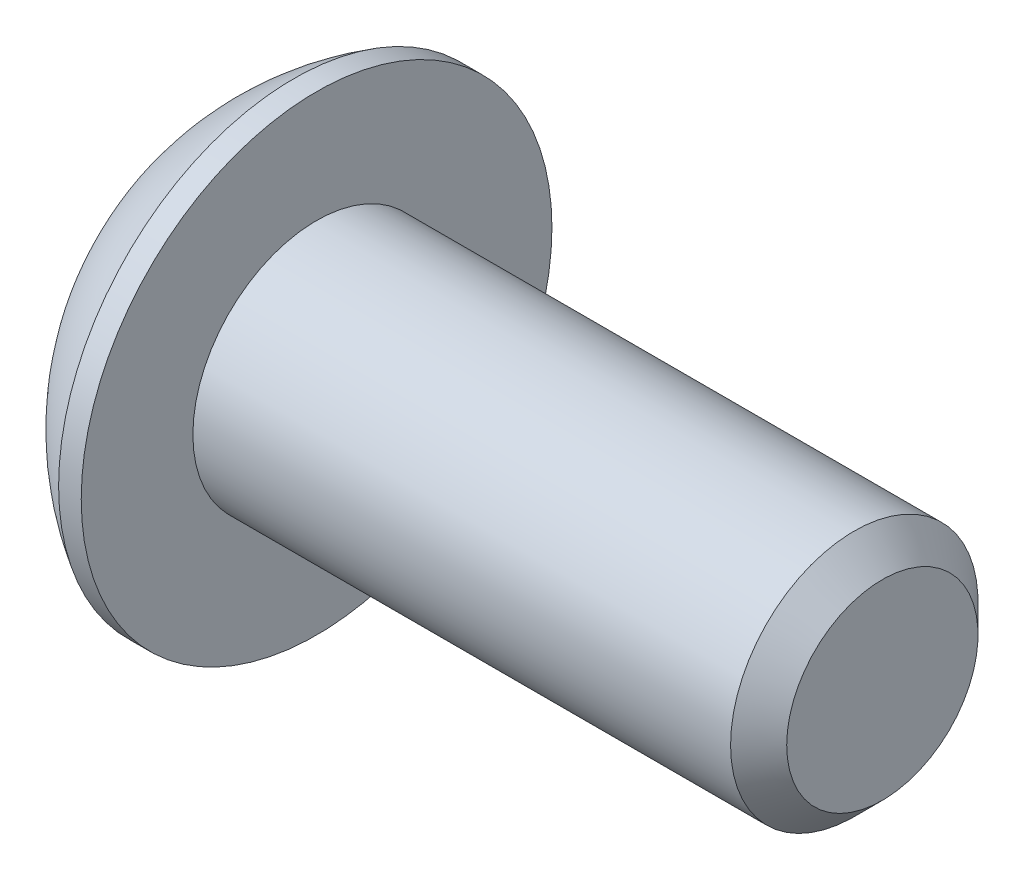
ISO-10303-21;
HEADER;
FILE_DESCRIPTION(('STEP AP214'),'2;1');
FILE_NAME('part.step','',(''),(''),'','','');
FILE_SCHEMA(('AUTOMOTIVE_DESIGN { 1 0 10303 214 1 1 1 1 }'));
ENDSEC;
DATA;
#1=APPLICATION_CONTEXT('core data for automotive mechanical design processes');
#2=APPLICATION_PROTOCOL_DEFINITION('international standard','automotive_design',2000,#1);
#3=PRODUCT_CONTEXT('',#1,'mechanical');
#4=PRODUCT('Part','Part','',(#3));
#5=PRODUCT_RELATED_PRODUCT_CATEGORY('part','',(#4));
#6=PRODUCT_DEFINITION_FORMATION('','',#4);
#7=PRODUCT_DEFINITION_CONTEXT('part definition',#1,'design');
#8=PRODUCT_DEFINITION('design','',#6,#7);
#9=PRODUCT_DEFINITION_SHAPE('','',#8);
#10=(LENGTH_UNIT() NAMED_UNIT(*) SI_UNIT(.MILLI.,.METRE.));
#11=(NAMED_UNIT(*) PLANE_ANGLE_UNIT() SI_UNIT($,.RADIAN.));
#12=(NAMED_UNIT(*) SI_UNIT($,.STERADIAN.) SOLID_ANGLE_UNIT());
#13=UNCERTAINTY_MEASURE_WITH_UNIT(LENGTH_MEASURE(1.E-05),#10,'distance_accuracy_value','');
#14=(GEOMETRIC_REPRESENTATION_CONTEXT(3) GLOBAL_UNCERTAINTY_ASSIGNED_CONTEXT((#13)) GLOBAL_UNIT_ASSIGNED_CONTEXT((#10,
#11,#12)) REPRESENTATION_CONTEXT('',''));
#15=CARTESIAN_POINT('',(0.,0.,0.));
#16=DIRECTION('',(0.,0.,1.));
#17=DIRECTION('',(1.,0.,0.));
#18=AXIS2_PLACEMENT_3D('',#15,#16,#17);
#19=CARTESIAN_POINT('',(1.32080000014412,0.,0.));
#20=DIRECTION('',(-1.,0.,0.));
#21=DIRECTION('',(0.,0.,1.));
#22=AXIS2_PLACEMENT_3D('',#19,#20,#21);
#23=CONICAL_SURFACE('',#22,1.19379999978264,1.04719755093309);
#24=CARTESIAN_POINT('',(2.01004075151445,0.,2.27373675443232E-10));
#25=VERTEX_POINT('',#24);
#26=VERTEX_LOOP('',#25);
#27=FACE_BOUND('',#26,.T.);
#28=CARTESIAN_POINT('',(1.32080000001284,0.,0.));
#29=DIRECTION('',(-1.,0.,0.));
#30=DIRECTION('',(0.,0.,1.));
#31=AXIS2_PLACEMENT_3D('',#28,#29,#30);
#32=CIRCLE('',#31,1.19380000001001);
#33=CARTESIAN_POINT('',(1.32080000000644,-1.0338611270422,0.596900000002507));
#34=VERTEX_POINT('',#33);
#35=CARTESIAN_POINT('',(1.32080000000644,0.,1.19380000000501));
#36=VERTEX_POINT('',#35);
#37=EDGE_CURVE('E91',#34,#36,#32,.T.);
#38=ORIENTED_EDGE('',*,*,#37,.T.);
#39=CARTESIAN_POINT('',(1.32080000001284,0.,0.));
#40=DIRECTION('',(-1.,0.,0.));
#41=DIRECTION('',(0.,0.,1.));
#42=AXIS2_PLACEMENT_3D('',#39,#40,#41);
#43=CIRCLE('',#42,1.19380000001001);
#44=CARTESIAN_POINT('',(1.32080000000644,1.0338611270422,0.596900000002507));
#45=VERTEX_POINT('',#44);
#46=EDGE_CURVE('E87',#36,#45,#43,.T.);
#47=ORIENTED_EDGE('',*,*,#46,.T.);
#48=CARTESIAN_POINT('',(1.32080000001284,0.,0.));
#49=DIRECTION('',(-1.,0.,0.));
#50=DIRECTION('',(0.,0.,1.));
#51=AXIS2_PLACEMENT_3D('',#48,#49,#50);
#52=CIRCLE('',#51,1.19380000001001);
#53=CARTESIAN_POINT('',(1.32080000000644,1.0338611270422,-0.596900000002503));
#54=VERTEX_POINT('',#53);
#55=EDGE_CURVE('E20',#45,#54,#52,.T.);
#56=ORIENTED_EDGE('',*,*,#55,.T.);
#57=CARTESIAN_POINT('',(1.32080000001284,0.,0.));
#58=DIRECTION('',(-1.,0.,0.));
#59=DIRECTION('',(0.,0.,1.));
#60=AXIS2_PLACEMENT_3D('',#57,#58,#59);
#61=CIRCLE('',#60,1.19380000001001);
#62=CARTESIAN_POINT('',(1.32080000000644,1.49193044797401E-12,-1.193800000005));
#63=VERTEX_POINT('',#62);
#64=EDGE_CURVE('E150',#54,#63,#61,.T.);
#65=ORIENTED_EDGE('',*,*,#64,.T.);
#66=CARTESIAN_POINT('',(1.32080000001284,0.,0.));
#67=DIRECTION('',(-1.,0.,0.));
#68=DIRECTION('',(0.,0.,1.));
#69=AXIS2_PLACEMENT_3D('',#66,#67,#68);
#70=CIRCLE('',#69,1.19380000001001);
#71=CARTESIAN_POINT('',(1.32080000000644,-1.03386112704219,-0.596900000002507));
#72=VERTEX_POINT('',#71);
#73=EDGE_CURVE('E152',#63,#72,#70,.T.);
#74=ORIENTED_EDGE('',*,*,#73,.T.);
#75=CARTESIAN_POINT('',(1.32080000001284,0.,0.));
#76=DIRECTION('',(-1.,0.,0.));
#77=DIRECTION('',(0.,0.,1.));
#78=AXIS2_PLACEMENT_3D('',#75,#76,#77);
#79=CIRCLE('',#78,1.19380000001001);
#80=EDGE_CURVE('E154',#72,#34,#79,.T.);
#81=ORIENTED_EDGE('',*,*,#80,.T.);
#82=EDGE_LOOP('',(#38,#47,#56,#65,#74,#81));
#83=FACE_BOUND('',#82,.T.);
#84=ADVANCED_FACE('F16',(#27,#83),#23,.F.);
#85=CARTESIAN_POINT('',(1.32080000000001,-2.06772225407572,-1.19379999999998));
#86=DIRECTION('',(1.,0.,0.));
#87=DIRECTION('',(0.,0.,-1.));
#88=AXIS2_PLACEMENT_3D('',#85,#86,#87);
#89=PLANE('',#88);
#90=DIRECTION('',(0.,-0.5,-0.866025403784439));
#91=VECTOR('',#90,1.);
#92=CARTESIAN_POINT('',(1.32080000000004,1.37848150271715,0.));
#93=LINE('',#92,#91);
#94=CARTESIAN_POINT('',(1.32080000000002,1.37848150271715,0.));
#95=VERTEX_POINT('',#94);
#96=EDGE_CURVE('E103',#54,#95,#93,.F.);
#97=ORIENTED_EDGE('',*,*,#96,.F.);
#98=ORIENTED_EDGE('',*,*,#55,.F.);
#99=DIRECTION('',(0.,0.5,-0.866025403784439));
#100=VECTOR('',#99,1.);
#101=CARTESIAN_POINT('',(1.32080000000001,0.689240751358577,1.1938));
#102=LINE('',#101,#100);
#103=EDGE_CURVE('E101',#95,#45,#102,.F.);
#104=ORIENTED_EDGE('',*,*,#103,.F.);
#105=EDGE_LOOP('',(#97,#98,#104));
#106=FACE_BOUND('',#105,.T.);
#107=ADVANCED_FACE('F99',(#106),#89,.F.);
#108=CARTESIAN_POINT('',(1.32080000000001,-2.06772225407572,-1.19379999999998));
#109=DIRECTION('',(1.,0.,0.));
#110=DIRECTION('',(0.,0.,-1.));
#111=AXIS2_PLACEMENT_3D('',#108,#109,#110);
#112=PLANE('',#111);
#113=DIRECTION('',(0.,0.5,-0.866025403784439));
#114=VECTOR('',#113,1.);
#115=CARTESIAN_POINT('',(1.32080000000004,0.689240751358577,1.1938));
#116=LINE('',#115,#114);
#117=CARTESIAN_POINT('',(1.32080000000002,0.689240751358577,1.1938));
#118=VERTEX_POINT('',#117);
#119=EDGE_CURVE('E105',#45,#118,#116,.F.);
#120=ORIENTED_EDGE('',*,*,#119,.F.);
#121=ORIENTED_EDGE('',*,*,#46,.F.);
#122=DIRECTION('',(0.,1.,0.));
#123=VECTOR('',#122,1.);
#124=CARTESIAN_POINT('',(1.32080000000001,-0.689240751358573,1.19380000000001));
#125=LINE('',#124,#123);
#126=EDGE_CURVE('E108',#118,#36,#125,.F.);
#127=ORIENTED_EDGE('',*,*,#126,.F.);
#128=EDGE_LOOP('',(#120,#121,#127));
#129=FACE_BOUND('',#128,.T.);
#130=ADVANCED_FACE('F106',(#129),#112,.F.);
#131=CARTESIAN_POINT('',(1.32080000000001,-2.06772225407572,-1.19379999999998));
#132=DIRECTION('',(1.,0.,0.));
#133=DIRECTION('',(0.,0.,-1.));
#134=AXIS2_PLACEMENT_3D('',#131,#132,#133);
#135=PLANE('',#134);
#136=DIRECTION('',(0.,1.,0.));
#137=VECTOR('',#136,1.);
#138=CARTESIAN_POINT('',(1.32080000000004,-0.689240751358573,1.19380000000001));
#139=LINE('',#138,#137);
#140=CARTESIAN_POINT('',(1.32080000000002,-0.689240751358577,1.19380000000001));
#141=VERTEX_POINT('',#140);
#142=EDGE_CURVE('E168',#36,#141,#139,.F.);
#143=ORIENTED_EDGE('',*,*,#142,.F.);
#144=ORIENTED_EDGE('',*,*,#37,.F.);
#145=DIRECTION('',(0.,0.5,0.866025403784439));
#146=VECTOR('',#145,1.);
#147=CARTESIAN_POINT('',(1.32080000000001,-1.37848150271715,0.));
#148=LINE('',#147,#146);
#149=EDGE_CURVE('E166',#141,#34,#148,.F.);
#150=ORIENTED_EDGE('',*,*,#149,.F.);
#151=EDGE_LOOP('',(#143,#144,#150));
#152=FACE_BOUND('',#151,.T.);
#153=ADVANCED_FACE('F164',(#152),#135,.F.);
#154=CARTESIAN_POINT('',(1.32080000000001,-2.06772225407572,-1.19379999999998));
#155=DIRECTION('',(1.,0.,0.));
#156=DIRECTION('',(0.,0.,-1.));
#157=AXIS2_PLACEMENT_3D('',#154,#155,#156);
#158=PLANE('',#157);
#159=DIRECTION('',(0.,0.5,0.866025403784439));
#160=VECTOR('',#159,1.);
#161=CARTESIAN_POINT('',(1.32080000000004,-1.37848150271715,0.));
#162=LINE('',#161,#160);
#163=CARTESIAN_POINT('',(1.32080000000002,-1.37848150271715,0.));
#164=VERTEX_POINT('',#163);
#165=EDGE_CURVE('E169',#34,#164,#162,.F.);
#166=ORIENTED_EDGE('',*,*,#165,.F.);
#167=ORIENTED_EDGE('',*,*,#80,.F.);
#168=DIRECTION('',(0.,-0.5,0.866025403784439));
#169=VECTOR('',#168,1.);
#170=CARTESIAN_POINT('',(1.32080000000001,-0.689240751358573,-1.19379999999999));
#171=LINE('',#170,#169);
#172=EDGE_CURVE('E172',#164,#72,#171,.F.);
#173=ORIENTED_EDGE('',*,*,#172,.F.);
#174=EDGE_LOOP('',(#166,#167,#173));
#175=FACE_BOUND('',#174,.T.);
#176=ADVANCED_FACE('F170',(#175),#158,.F.);
#177=CARTESIAN_POINT('',(1.32080000000001,-2.06772225407572,-1.19379999999998));
#178=DIRECTION('',(1.,0.,0.));
#179=DIRECTION('',(0.,0.,-1.));
#180=AXIS2_PLACEMENT_3D('',#177,#178,#179);
#181=PLANE('',#180);
#182=DIRECTION('',(0.,-0.5,0.866025403784439));
#183=VECTOR('',#182,1.);
#184=CARTESIAN_POINT('',(1.32080000000004,-0.689240751358573,-1.19379999999999));
#185=LINE('',#184,#183);
#186=CARTESIAN_POINT('',(1.32080000000002,-0.689240751358573,-1.19379999999999));
#187=VERTEX_POINT('',#186);
#188=EDGE_CURVE('E227',#72,#187,#185,.F.);
#189=ORIENTED_EDGE('',*,*,#188,.F.);
#190=ORIENTED_EDGE('',*,*,#73,.F.);
#191=DIRECTION('',(0.,1.,0.));
#192=VECTOR('',#191,1.);
#193=CARTESIAN_POINT('',(1.32080000000001,0.689240751358577,-1.19379999999999));
#194=LINE('',#193,#192);
#195=EDGE_CURVE('E239',#187,#63,#194,.T.);
#196=ORIENTED_EDGE('',*,*,#195,.F.);
#197=EDGE_LOOP('',(#189,#190,#196));
#198=FACE_BOUND('',#197,.T.);
#199=ADVANCED_FACE('F389',(#198),#181,.F.);
#200=CARTESIAN_POINT('',(1.32080000000001,-2.06772225407572,-1.19379999999998));
#201=DIRECTION('',(1.,0.,0.));
#202=DIRECTION('',(0.,0.,-1.));
#203=AXIS2_PLACEMENT_3D('',#200,#201,#202);
#204=PLANE('',#203);
#205=DIRECTION('',(0.,1.,0.));
#206=VECTOR('',#205,1.);
#207=CARTESIAN_POINT('',(1.32080000000004,0.689240751358577,-1.19379999999999));
#208=LINE('',#207,#206);
#209=CARTESIAN_POINT('',(1.32080000000002,0.689240751358564,-1.19380000000002));
#210=VERTEX_POINT('',#209);
#211=EDGE_CURVE('E247',#63,#210,#208,.T.);
#212=ORIENTED_EDGE('',*,*,#211,.F.);
#213=ORIENTED_EDGE('',*,*,#64,.F.);
#214=DIRECTION('',(0.,-0.5,-0.866025403784439));
#215=VECTOR('',#214,1.);
#216=CARTESIAN_POINT('',(1.32080000000001,1.37848150271715,0.));
#217=LINE('',#216,#215);
#218=EDGE_CURVE('E127',#210,#54,#217,.F.);
#219=ORIENTED_EDGE('',*,*,#218,.F.);
#220=EDGE_LOOP('',(#212,#213,#219));
#221=FACE_BOUND('',#220,.T.);
#222=ADVANCED_FACE('F379',(#221),#204,.F.);
#223=CARTESIAN_POINT('',(1.32080000000001,1.37848150271715,0.));
#224=DIRECTION('',(0.,-0.866025403784439,0.5));
#225=DIRECTION('',(0.,-0.5,-0.866025403784439));
#226=AXIS2_PLACEMENT_3D('',#223,#224,#225);
#227=PLANE('',#226);
#228=ORIENTED_EDGE('',*,*,#96,.T.);
#229=DIRECTION('',(1.,0.,0.));
#230=VECTOR('',#229,1.);
#231=CARTESIAN_POINT('',(1.32080000000001,1.37848150271715,0.));
#232=LINE('',#231,#230);
#233=CARTESIAN_POINT('',(0.,1.37848150271715,0.));
#234=VERTEX_POINT('',#233);
#235=EDGE_CURVE('E115',#234,#95,#232,.T.);
#236=ORIENTED_EDGE('',*,*,#235,.F.);
#237=DIRECTION('',(0.,0.499999999999998,0.86602540378444));
#238=VECTOR('',#237,1.);
#239=CARTESIAN_POINT('',(0.,0.689240751358577,-1.1938));
#240=LINE('',#239,#238);
#241=CARTESIAN_POINT('',(0.,0.689240751358577,-1.1938));
#242=VERTEX_POINT('',#241);
#243=EDGE_CURVE('E130',#242,#234,#240,.T.);
#244=ORIENTED_EDGE('',*,*,#243,.F.);
#245=DIRECTION('',(1.,0.,0.));
#246=VECTOR('',#245,1.);
#247=CARTESIAN_POINT('',(1.32080000000001,0.689240751358577,-1.19379999999999));
#248=LINE('',#247,#246);
#249=EDGE_CURVE('E134',#210,#242,#248,.F.);
#250=ORIENTED_EDGE('',*,*,#249,.F.);
#251=ORIENTED_EDGE('',*,*,#218,.T.);
#252=EDGE_LOOP('',(#228,#236,#244,#250,#251));
#253=FACE_BOUND('',#252,.T.);
#254=ADVANCED_FACE('F370',(#253),#227,.T.);
#255=CARTESIAN_POINT('',(1.32080000000001,0.689240751358577,1.1938));
#256=DIRECTION('',(0.,-0.866025403784439,-0.5));
#257=DIRECTION('',(0.,0.5,-0.866025403784439));
#258=AXIS2_PLACEMENT_3D('',#255,#256,#257);
#259=PLANE('',#258);
#260=ORIENTED_EDGE('',*,*,#119,.T.);
#261=DIRECTION('',(1.,0.,0.));
#262=VECTOR('',#261,1.);
#263=CARTESIAN_POINT('',(1.32080000000001,0.689240751358577,1.19380000000001));
#264=LINE('',#263,#262);
#265=CARTESIAN_POINT('',(0.,0.689240751358577,1.1938));
#266=VERTEX_POINT('',#265);
#267=EDGE_CURVE('E111',#266,#118,#264,.T.);
#268=ORIENTED_EDGE('',*,*,#267,.F.);
#269=DIRECTION('',(0.,-0.500000000000004,0.866025403784437));
#270=VECTOR('',#269,1.);
#271=CARTESIAN_POINT('',(0.,1.37848150271715,0.));
#272=LINE('',#271,#270);
#273=EDGE_CURVE('E133',#234,#266,#272,.T.);
#274=ORIENTED_EDGE('',*,*,#273,.F.);
#275=ORIENTED_EDGE('',*,*,#235,.T.);
#276=ORIENTED_EDGE('',*,*,#103,.T.);
#277=EDGE_LOOP('',(#260,#268,#274,#275,#276));
#278=FACE_BOUND('',#277,.T.);
#279=ADVANCED_FACE('F113',(#278),#259,.T.);
#280=CARTESIAN_POINT('',(1.32080000000001,-0.689240751358573,1.19380000000001));
#281=DIRECTION('',(0.,0.,-1.));
#282=DIRECTION('',(0.,1.,0.));
#283=AXIS2_PLACEMENT_3D('',#280,#281,#282);
#284=PLANE('',#283);
#285=ORIENTED_EDGE('',*,*,#142,.T.);
#286=DIRECTION('',(1.,0.,0.));
#287=VECTOR('',#286,1.);
#288=CARTESIAN_POINT('',(1.32080000000001,-0.689240751358579,1.19380000000001));
#289=LINE('',#288,#287);
#290=CARTESIAN_POINT('',(0.,-0.689240751358577,1.19380000000001));
#291=VERTEX_POINT('',#290);
#292=EDGE_CURVE('E179',#291,#141,#289,.T.);
#293=ORIENTED_EDGE('',*,*,#292,.F.);
#294=DIRECTION('',(0.,1.,0.));
#295=VECTOR('',#294,1.);
#296=CARTESIAN_POINT('',(0.,0.,1.1938));
#297=LINE('',#296,#295);
#298=EDGE_CURVE('E193',#266,#291,#297,.F.);
#299=ORIENTED_EDGE('',*,*,#298,.F.);
#300=ORIENTED_EDGE('',*,*,#267,.T.);
#301=ORIENTED_EDGE('',*,*,#126,.T.);
#302=EDGE_LOOP('',(#285,#293,#299,#300,#301));
#303=FACE_BOUND('',#302,.T.);
#304=ADVANCED_FACE('F215',(#303),#284,.T.);
#305=CARTESIAN_POINT('',(1.32080000000001,-1.37848150271715,0.));
#306=DIRECTION('',(0.,0.866025403784439,-0.5));
#307=DIRECTION('',(0.,0.5,0.866025403784439));
#308=AXIS2_PLACEMENT_3D('',#305,#306,#307);
#309=PLANE('',#308);
#310=ORIENTED_EDGE('',*,*,#165,.T.);
#311=DIRECTION('',(1.,0.,0.));
#312=VECTOR('',#311,1.);
#313=CARTESIAN_POINT('',(1.32080000000001,-1.37848150271715,0.));
#314=LINE('',#313,#312);
#315=CARTESIAN_POINT('',(0.,-1.37848150271715,0.));
#316=VERTEX_POINT('',#315);
#317=EDGE_CURVE('E175',#316,#164,#314,.T.);
#318=ORIENTED_EDGE('',*,*,#317,.F.);
#319=DIRECTION('',(0.,-0.499999999999999,-0.866025403784439));
#320=VECTOR('',#319,1.);
#321=CARTESIAN_POINT('',(0.,-0.689240751358573,1.19380000000001));
#322=LINE('',#321,#320);
#323=EDGE_CURVE('E196',#291,#316,#322,.T.);
#324=ORIENTED_EDGE('',*,*,#323,.F.);
#325=ORIENTED_EDGE('',*,*,#292,.T.);
#326=ORIENTED_EDGE('',*,*,#149,.T.);
#327=EDGE_LOOP('',(#310,#318,#324,#325,#326));
#328=FACE_BOUND('',#327,.T.);
#329=ADVANCED_FACE('F177',(#328),#309,.T.);
#330=CARTESIAN_POINT('',(1.32080000000001,-0.689240751358573,-1.19379999999999));
#331=DIRECTION('',(0.,0.866025403784439,0.5));
#332=DIRECTION('',(0.,-0.5,0.866025403784439));
#333=AXIS2_PLACEMENT_3D('',#330,#331,#332);
#334=PLANE('',#333);
#335=ORIENTED_EDGE('',*,*,#188,.T.);
#336=DIRECTION('',(1.,0.,0.));
#337=VECTOR('',#336,1.);
#338=CARTESIAN_POINT('',(1.32080000000001,-0.689240751358573,-1.19379999999999));
#339=LINE('',#338,#337);
#340=CARTESIAN_POINT('',(0.,-0.689240751358573,-1.19379999999999));
#341=VERTEX_POINT('',#340);
#342=EDGE_CURVE('E35',#341,#187,#339,.T.);
#343=ORIENTED_EDGE('',*,*,#342,.F.);
#344=DIRECTION('',(0.,0.499999999999998,-0.86602540378444));
#345=VECTOR('',#344,1.);
#346=CARTESIAN_POINT('',(0.,-1.37848150271715,0.));
#347=LINE('',#346,#345);
#348=EDGE_CURVE('E216',#316,#341,#347,.T.);
#349=ORIENTED_EDGE('',*,*,#348,.F.);
#350=ORIENTED_EDGE('',*,*,#317,.T.);
#351=ORIENTED_EDGE('',*,*,#172,.T.);
#352=EDGE_LOOP('',(#335,#343,#349,#350,#351));
#353=FACE_BOUND('',#352,.T.);
#354=ADVANCED_FACE('F336',(#353),#334,.T.);
#355=CARTESIAN_POINT('',(1.32080000000001,0.689240751358577,-1.19379999999999));
#356=DIRECTION('',(0.,0.,1.));
#357=DIRECTION('',(1.,0.,0.));
#358=AXIS2_PLACEMENT_3D('',#355,#356,#357);
#359=PLANE('',#358);
#360=ORIENTED_EDGE('',*,*,#211,.T.);
#361=ORIENTED_EDGE('',*,*,#249,.T.);
#362=DIRECTION('',(0.,1.,0.));
#363=VECTOR('',#362,1.);
#364=CARTESIAN_POINT('',(0.,0.,-1.19379999999999));
#365=LINE('',#364,#363);
#366=EDGE_CURVE('E149',#341,#242,#365,.T.);
#367=ORIENTED_EDGE('',*,*,#366,.F.);
#368=ORIENTED_EDGE('',*,*,#342,.T.);
#369=ORIENTED_EDGE('',*,*,#195,.T.);
#370=EDGE_LOOP('',(#360,#361,#367,#368,#369));
#371=FACE_BOUND('',#370,.T.);
#372=ADVANCED_FACE('F327',(#371),#359,.T.);
#373=CARTESIAN_POINT('',(0.,0.,0.));
#374=DIRECTION('',(-1.,0.,0.));
#375=DIRECTION('',(0.,0.,1.));
#376=AXIS2_PLACEMENT_3D('',#373,#374,#375);
#377=PLANE('',#376);
#378=CARTESIAN_POINT('',(0.,0.,0.));
#379=DIRECTION('',(-1.,0.,0.));
#380=DIRECTION('',(0.,0.,1.));
#381=AXIS2_PLACEMENT_3D('',#378,#379,#380);
#382=CIRCLE('',#381,1.98120000000003);
#383=CARTESIAN_POINT('',(0.,0.,1.98120000000004));
#384=VERTEX_POINT('',#383);
#385=EDGE_CURVE('E146',#384,#384,#382,.F.);
#386=ORIENTED_EDGE('',*,*,#385,.F.);
#387=EDGE_LOOP('',(#386));
#388=FACE_BOUND('',#387,.T.);
#389=ORIENTED_EDGE('',*,*,#348,.T.);
#390=ORIENTED_EDGE('',*,*,#366,.T.);
#391=ORIENTED_EDGE('',*,*,#243,.T.);
#392=ORIENTED_EDGE('',*,*,#273,.T.);
#393=ORIENTED_EDGE('',*,*,#298,.T.);
#394=ORIENTED_EDGE('',*,*,#323,.T.);
#395=EDGE_LOOP('',(#389,#390,#391,#392,#393,#394));
#396=FACE_BOUND('',#395,.T.);
#397=ADVANCED_FACE('F209',(#388,#396),#377,.T.);
#398=CARTESIAN_POINT('',(4.13384999999999,0.,0.));
#399=DIRECTION('',(0.,1.,0.));
#400=DIRECTION('',(-0.48966740395494,0.,-0.87190930348519));
#401=AXIS2_PLACEMENT_3D('',#398,#399,#400);
#402=SPHERICAL_SURFACE('',#401,4.5840887057844);
#403=CARTESIAN_POINT('',(4.13384999999999,0.,0.));
#404=DIRECTION('',(-1.,0.,0.));
#405=DIRECTION('',(0.,0.,1.));
#406=AXIS2_PLACEMENT_3D('',#403,#404,#405);
#407=SPHERICAL_SURFACE('',#406,4.5840887057844);
#408=ORIENTED_EDGE('',*,*,#385,.T.);
#409=EDGE_LOOP('',(#408));
#410=FACE_BOUND('',#409,.T.);
#411=CARTESIAN_POINT('',(1.82879999999999,0.,0.));
#412=DIRECTION('',(-1.,0.,0.));
#413=DIRECTION('',(0.,0.,1.));
#414=AXIS2_PLACEMENT_3D('',#411,#412,#413);
#415=CIRCLE('',#414,3.9624);
#416=CARTESIAN_POINT('',(1.82879999999999,0.,3.9624));
#417=VERTEX_POINT('',#416);
#418=EDGE_CURVE('E143',#417,#417,#415,.F.);
#419=ORIENTED_EDGE('',*,*,#418,.F.);
#420=EDGE_LOOP('',(#419));
#421=FACE_BOUND('',#420,.T.);
#422=ADVANCED_FACE('F18',(#410,#421),#407,.T.);
#423=CARTESIAN_POINT('',(11.7348,0.,0.));
#424=DIRECTION('',(-1.,0.,0.));
#425=DIRECTION('',(0.,0.,1.));
#426=AXIS2_PLACEMENT_3D('',#423,#424,#425);
#427=PLANE('',#426);
#428=CARTESIAN_POINT('',(11.7347999998856,0.,0.));
#429=DIRECTION('',(-1.,0.,0.));
#430=DIRECTION('',(0.,0.,1.));
#431=AXIS2_PLACEMENT_3D('',#428,#429,#430);
#432=CIRCLE('',#431,1.61036000008608);
#433=CARTESIAN_POINT('',(11.7347999998856,0.,1.61036000008608));
#434=VERTEX_POINT('',#433);
#435=EDGE_CURVE('E140',#434,#434,#432,.T.);
#436=ORIENTED_EDGE('',*,*,#435,.F.);
#437=EDGE_LOOP('',(#436));
#438=FACE_BOUND('',#437,.T.);
#439=ADVANCED_FACE('F269',(#438),#427,.F.);
#440=CARTESIAN_POINT('',(0.,0.,0.));
#441=DIRECTION('',(-1.,0.,0.));
#442=DIRECTION('',(0.,0.,1.));
#443=AXIS2_PLACEMENT_3D('',#440,#441,#442);
#444=CYLINDRICAL_SURFACE('',#443,3.9624);
#445=ORIENTED_EDGE('',*,*,#418,.T.);
#446=EDGE_LOOP('',(#445));
#447=FACE_BOUND('',#446,.T.);
#448=CARTESIAN_POINT('',(2.20980000000001,0.,0.));
#449=DIRECTION('',(-1.,0.,0.));
#450=DIRECTION('',(0.,0.,1.));
#451=AXIS2_PLACEMENT_3D('',#448,#449,#450);
#452=CIRCLE('',#451,3.9624);
#453=CARTESIAN_POINT('',(2.20980000000001,0.,3.9624));
#454=VERTEX_POINT('',#453);
#455=EDGE_CURVE('E137',#454,#454,#452,.T.);
#456=ORIENTED_EDGE('',*,*,#455,.T.);
#457=EDGE_LOOP('',(#456));
#458=FACE_BOUND('',#457,.T.);
#459=ADVANCED_FACE('F265',(#447,#458),#444,.T.);
#460=CARTESIAN_POINT('',(11.2623600000461,0.,0.));
#461=DIRECTION('',(-1.,0.,0.));
#462=DIRECTION('',(0.,0.,1.));
#463=AXIS2_PLACEMENT_3D('',#460,#461,#462);
#464=CONICAL_SURFACE('',#463,2.08279999992556,0.785398163397448);
#465=CARTESIAN_POINT('',(11.26236,0.,0.));
#466=DIRECTION('',(-1.,0.,0.));
#467=DIRECTION('',(0.,0.,1.));
#468=AXIS2_PLACEMENT_3D('',#465,#466,#467);
#469=CIRCLE('',#468,2.0828);
#470=CARTESIAN_POINT('',(11.26236,0.,2.0828));
#471=VERTEX_POINT('',#470);
#472=EDGE_CURVE('E26',#471,#471,#469,.T.);
#473=ORIENTED_EDGE('',*,*,#472,.F.);
#474=EDGE_LOOP('',(#473));
#475=FACE_BOUND('',#474,.T.);
#476=ORIENTED_EDGE('',*,*,#435,.T.);
#477=EDGE_LOOP('',(#476));
#478=FACE_BOUND('',#477,.T.);
#479=ADVANCED_FACE('F261',(#475,#478),#464,.T.);
#480=CARTESIAN_POINT('',(2.20980000000001,2.0828,0.));
#481=DIRECTION('',(-1.,0.,0.));
#482=DIRECTION('',(0.,0.,1.));
#483=AXIS2_PLACEMENT_3D('',#480,#481,#482);
#484=PLANE('',#483);
#485=ORIENTED_EDGE('',*,*,#455,.F.);
#486=EDGE_LOOP('',(#485));
#487=FACE_BOUND('',#486,.T.);
#488=CARTESIAN_POINT('',(2.20980000000001,0.,0.));
#489=DIRECTION('',(-1.,0.,0.));
#490=DIRECTION('',(0.,0.,1.));
#491=AXIS2_PLACEMENT_3D('',#488,#489,#490);
#492=CIRCLE('',#491,2.0828);
#493=CARTESIAN_POINT('',(2.20980000000001,0.,2.0828));
#494=VERTEX_POINT('',#493);
#495=EDGE_CURVE('E11',#494,#494,#492,.F.);
#496=ORIENTED_EDGE('',*,*,#495,.F.);
#497=EDGE_LOOP('',(#496));
#498=FACE_BOUND('',#497,.T.);
#499=ADVANCED_FACE('F264',(#487,#498),#484,.F.);
#500=CARTESIAN_POINT('',(0.,0.,0.));
#501=DIRECTION('',(-1.,0.,0.));
#502=DIRECTION('',(0.,0.,1.));
#503=AXIS2_PLACEMENT_3D('',#500,#501,#502);
#504=CYLINDRICAL_SURFACE('',#503,2.0828);
#505=ORIENTED_EDGE('',*,*,#495,.T.);
#506=EDGE_LOOP('',(#505));
#507=FACE_BOUND('',#506,.T.);
#508=ORIENTED_EDGE('',*,*,#472,.T.);
#509=EDGE_LOOP('',(#508));
#510=FACE_BOUND('',#509,.T.);
#511=ADVANCED_FACE('F259',(#507,#510),#504,.T.);
#512=CLOSED_SHELL('',(#84,#107,#130,#153,#176,#199,#222,#254,#279,#304,#329,#354,#372,#397,#422,
#439,#459,#479,#499,#511));
#513=MANIFOLD_SOLID_BREP('B1',#512);
#514=ADVANCED_BREP_SHAPE_REPRESENTATION('',(#18,#513),#14);
#515=SHAPE_DEFINITION_REPRESENTATION(#9,#514);
ENDSEC;
END-ISO-10303-21;
